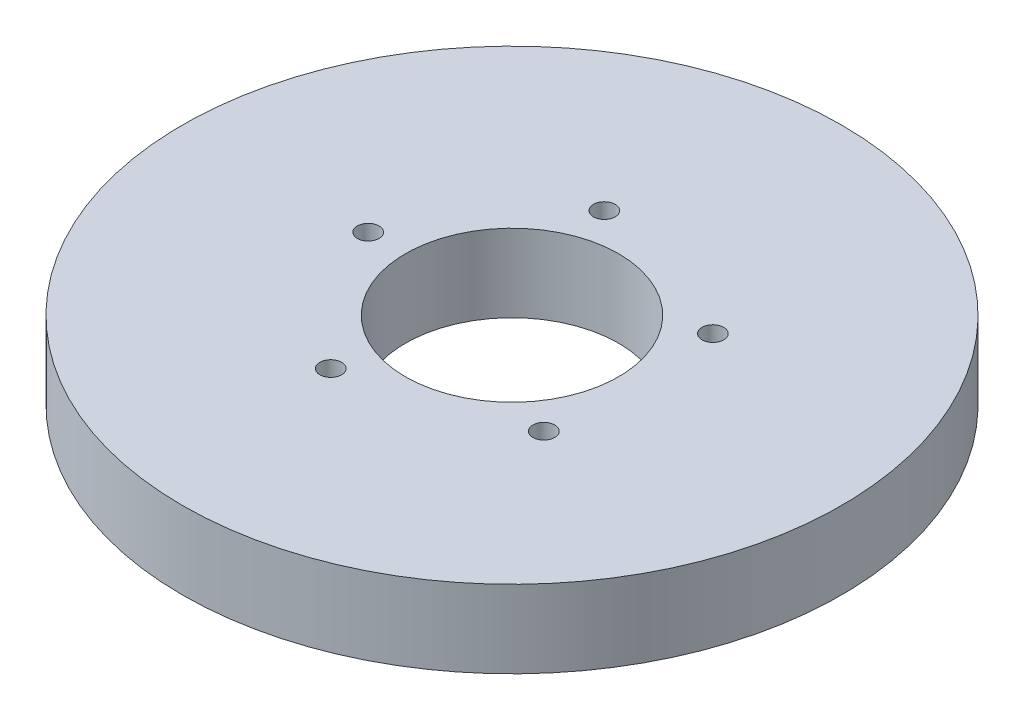
ISO-10303-21;
HEADER;
FILE_DESCRIPTION(('STEP AP214'),'2;1');
FILE_NAME('part.step','',(''),(''),'','','');
FILE_SCHEMA(('AUTOMOTIVE_DESIGN { 1 0 10303 214 1 1 1 1 }'));
ENDSEC;
DATA;
#1=APPLICATION_CONTEXT('core data for automotive mechanical design processes');
#2=APPLICATION_PROTOCOL_DEFINITION('international standard','automotive_design',2000,#1);
#3=PRODUCT_CONTEXT('',#1,'mechanical');
#4=PRODUCT('Part','Part','',(#3));
#5=PRODUCT_RELATED_PRODUCT_CATEGORY('part','',(#4));
#6=PRODUCT_DEFINITION_FORMATION('','',#4);
#7=PRODUCT_DEFINITION_CONTEXT('part definition',#1,'design');
#8=PRODUCT_DEFINITION('design','',#6,#7);
#9=PRODUCT_DEFINITION_SHAPE('','',#8);
#10=(LENGTH_UNIT() NAMED_UNIT(*) SI_UNIT(.MILLI.,.METRE.));
#11=(NAMED_UNIT(*) PLANE_ANGLE_UNIT() SI_UNIT($,.RADIAN.));
#12=(NAMED_UNIT(*) SI_UNIT($,.STERADIAN.) SOLID_ANGLE_UNIT());
#13=UNCERTAINTY_MEASURE_WITH_UNIT(LENGTH_MEASURE(1.E-05),#10,'distance_accuracy_value','');
#14=(GEOMETRIC_REPRESENTATION_CONTEXT(3) GLOBAL_UNCERTAINTY_ASSIGNED_CONTEXT((#13)) GLOBAL_UNIT_ASSIGNED_CONTEXT((#10,
#11,#12)) REPRESENTATION_CONTEXT('',''));
#15=CARTESIAN_POINT('',(0.,0.,0.));
#16=DIRECTION('',(0.,0.,1.));
#17=DIRECTION('',(1.,0.,0.));
#18=AXIS2_PLACEMENT_3D('',#15,#16,#17);
#19=CARTESIAN_POINT('',(0.,20.,0.));
#20=DIRECTION('',(0.,-1.,0.));
#21=DIRECTION('',(0.,0.,-1.));
#22=AXIS2_PLACEMENT_3D('',#19,#20,#21);
#23=CYLINDRICAL_SURFACE('',#22,85.);
#24=CARTESIAN_POINT('',(0.,20.,0.));
#25=DIRECTION('',(0.,1.,0.));
#26=DIRECTION('',(0.,0.,1.));
#27=AXIS2_PLACEMENT_3D('',#24,#25,#26);
#28=CIRCLE('',#27,85.);
#29=CARTESIAN_POINT('',(0.,20.,85.));
#30=VERTEX_POINT('',#29);
#31=EDGE_CURVE('E10',#30,#30,#28,.T.);
#32=ORIENTED_EDGE('',*,*,#31,.F.);
#33=EDGE_LOOP('',(#32));
#34=FACE_BOUND('',#33,.T.);
#35=CARTESIAN_POINT('',(0.,0.,0.));
#36=DIRECTION('',(0.,1.,0.));
#37=DIRECTION('',(0.,0.,1.));
#38=AXIS2_PLACEMENT_3D('',#35,#36,#37);
#39=CIRCLE('',#38,85.);
#40=CARTESIAN_POINT('',(0.,0.,85.));
#41=VERTEX_POINT('',#40);
#42=EDGE_CURVE('E37',#41,#41,#39,.T.);
#43=ORIENTED_EDGE('',*,*,#42,.T.);
#44=EDGE_LOOP('',(#43));
#45=FACE_BOUND('',#44,.T.);
#46=ADVANCED_FACE('F40',(#34,#45),#23,.T.);
#47=CARTESIAN_POINT('',(0.,20.,0.));
#48=DIRECTION('',(0.,1.,0.));
#49=DIRECTION('',(0.,0.,1.));
#50=AXIS2_PLACEMENT_3D('',#47,#48,#49);
#51=PLANE('',#50);
#52=CARTESIAN_POINT('',(-11.4625068656685,20.,35.2779686752267));
#53=DIRECTION('',(0.,1.,0.));
#54=DIRECTION('',(0.951056516295155,0.,0.309016994374945));
#55=AXIS2_PLACEMENT_3D('',#52,#53,#54);
#56=CIRCLE('',#55,2.80475320982171);
#57=CARTESIAN_POINT('',(-8.79502804886783,20.,36.1446850820893));
#58=VERTEX_POINT('',#57);
#59=EDGE_CURVE('E78',#58,#58,#56,.T.);
#60=ORIENTED_EDGE('',*,*,#59,.F.);
#61=EDGE_LOOP('',(#60));
#62=FACE_BOUND('',#61,.T.);
#63=CARTESIAN_POINT('',(30.0092325705996,20.,21.802983695344));
#64=DIRECTION('',(0.,1.,0.));
#65=DIRECTION('',(0.587785252292469,0.,-0.809016994374951));
#66=AXIS2_PLACEMENT_3D('',#63,#64,#65);
#67=CIRCLE('',#66,2.80475320982171);
#68=CARTESIAN_POINT('',(31.6578251436528,20.,19.5338906835705));
#69=VERTEX_POINT('',#68);
#70=EDGE_CURVE('E71',#69,#69,#67,.T.);
#71=ORIENTED_EDGE('',*,*,#70,.F.);
#72=EDGE_LOOP('',(#71));
#73=FACE_BOUND('',#72,.T.);
#74=CARTESIAN_POINT('',(30.0092325705993,20.,-21.8029836953444));
#75=DIRECTION('',(0.,1.,0.));
#76=DIRECTION('',(-0.58778525229248,0.,-0.809016994374942));
#77=AXIS2_PLACEMENT_3D('',#74,#75,#76);
#78=CIRCLE('',#77,2.80475320982171);
#79=CARTESIAN_POINT('',(28.3606399975461,20.,-24.0720767071179));
#80=VERTEX_POINT('',#79);
#81=EDGE_CURVE('E70',#80,#80,#78,.T.);
#82=ORIENTED_EDGE('',*,*,#81,.F.);
#83=EDGE_LOOP('',(#82));
#84=FACE_BOUND('',#83,.T.);
#85=CARTESIAN_POINT('',(-11.462506865669,20.,-35.2779686752265));
#86=DIRECTION('',(0.,1.,0.));
#87=DIRECTION('',(-0.95105651629515,0.,0.309016994374958));
#88=AXIS2_PLACEMENT_3D('',#85,#86,#87);
#89=CIRCLE('',#88,2.80475320982171);
#90=CARTESIAN_POINT('',(-14.1299856824697,20.,-34.4112522683639));
#91=VERTEX_POINT('',#90);
#92=EDGE_CURVE('E61',#91,#91,#89,.T.);
#93=ORIENTED_EDGE('',*,*,#92,.F.);
#94=EDGE_LOOP('',(#93));
#95=FACE_BOUND('',#94,.T.);
#96=CARTESIAN_POINT('',(-37.0934514098617,20.,0.));
#97=DIRECTION('',(0.,1.,0.));
#98=DIRECTION('',(0.,0.,1.));
#99=AXIS2_PLACEMENT_3D('',#96,#97,#98);
#100=CIRCLE('',#99,2.80475320982171);
#101=CARTESIAN_POINT('',(-37.0934514098617,20.,2.80475320982171));
#102=VERTEX_POINT('',#101);
#103=EDGE_CURVE('E54',#102,#102,#100,.T.);
#104=ORIENTED_EDGE('',*,*,#103,.F.);
#105=EDGE_LOOP('',(#104));
#106=FACE_BOUND('',#105,.T.);
#107=CARTESIAN_POINT('',(0.,20.,0.));
#108=DIRECTION('',(0.,1.,0.));
#109=DIRECTION('',(0.,0.,1.));
#110=AXIS2_PLACEMENT_3D('',#107,#108,#109);
#111=CIRCLE('',#110,27.5);
#112=CARTESIAN_POINT('',(0.,20.,27.5));
#113=VERTEX_POINT('',#112);
#114=EDGE_CURVE('E50',#113,#113,#111,.T.);
#115=ORIENTED_EDGE('',*,*,#114,.F.);
#116=EDGE_LOOP('',(#115));
#117=FACE_BOUND('',#116,.T.);
#118=ORIENTED_EDGE('',*,*,#31,.T.);
#119=EDGE_LOOP('',(#118));
#120=FACE_BOUND('',#119,.T.);
#121=ADVANCED_FACE('F94',(#62,#73,#84,#95,#106,#117,#120),#51,.T.);
#122=CARTESIAN_POINT('',(0.,0.,0.));
#123=DIRECTION('',(0.,1.,0.));
#124=DIRECTION('',(0.,0.,1.));
#125=AXIS2_PLACEMENT_3D('',#122,#123,#124);
#126=PLANE('',#125);
#127=CARTESIAN_POINT('',(0.,0.,0.));
#128=DIRECTION('',(0.,1.,0.));
#129=DIRECTION('',(0.,0.,1.));
#130=AXIS2_PLACEMENT_3D('',#127,#128,#129);
#131=CIRCLE('',#130,27.5);
#132=CARTESIAN_POINT('',(0.,0.,27.5));
#133=VERTEX_POINT('',#132);
#134=EDGE_CURVE('E47',#133,#133,#131,.T.);
#135=ORIENTED_EDGE('',*,*,#134,.T.);
#136=EDGE_LOOP('',(#135));
#137=FACE_BOUND('',#136,.T.);
#138=ORIENTED_EDGE('',*,*,#42,.F.);
#139=EDGE_LOOP('',(#138));
#140=FACE_BOUND('',#139,.T.);
#141=ADVANCED_FACE('F100',(#137,#140),#126,.F.);
#142=CARTESIAN_POINT('',(0.,20.,0.));
#143=DIRECTION('',(0.,-1.,0.));
#144=DIRECTION('',(0.,0.,-1.));
#145=AXIS2_PLACEMENT_3D('',#142,#143,#144);
#146=CYLINDRICAL_SURFACE('',#145,27.5);
#147=ORIENTED_EDGE('',*,*,#114,.T.);
#148=EDGE_LOOP('',(#147));
#149=FACE_BOUND('',#148,.T.);
#150=ORIENTED_EDGE('',*,*,#134,.F.);
#151=EDGE_LOOP('',(#150));
#152=FACE_BOUND('',#151,.T.);
#153=ADVANCED_FACE('F108',(#149,#152),#146,.F.);
#154=CARTESIAN_POINT('',(-37.0934514098617,2.33509567441192,0.));
#155=DIRECTION('',(0.,1.,0.));
#156=DIRECTION('',(0.,0.,1.));
#157=AXIS2_PLACEMENT_3D('',#154,#155,#156);
#158=CYLINDRICAL_SURFACE('',#157,2.80475320982171);
#159=CARTESIAN_POINT('',(-37.0934514098617,2.33509567441192,0.));
#160=DIRECTION('',(0.,1.,0.));
#161=DIRECTION('',(0.,0.,1.));
#162=AXIS2_PLACEMENT_3D('',#159,#160,#161);
#163=CIRCLE('',#162,2.80475320982171);
#164=CARTESIAN_POINT('',(-37.0934514098617,2.33509567441192,2.80475320982171));
#165=VERTEX_POINT('',#164);
#166=EDGE_CURVE('E55',#165,#165,#163,.T.);
#167=ORIENTED_EDGE('',*,*,#166,.F.);
#168=EDGE_LOOP('',(#167));
#169=FACE_BOUND('',#168,.T.);
#170=ORIENTED_EDGE('',*,*,#103,.T.);
#171=EDGE_LOOP('',(#170));
#172=FACE_BOUND('',#171,.T.);
#173=ADVANCED_FACE('F115',(#169,#172),#158,.F.);
#174=CARTESIAN_POINT('',(-37.0934514098617,2.33509567441192,0.));
#175=DIRECTION('',(0.,1.,0.));
#176=DIRECTION('',(0.,0.,1.));
#177=AXIS2_PLACEMENT_3D('',#174,#175,#176);
#178=PLANE('',#177);
#179=ORIENTED_EDGE('',*,*,#166,.T.);
#180=EDGE_LOOP('',(#179));
#181=FACE_BOUND('',#180,.T.);
#182=ADVANCED_FACE('F142',(#181),#178,.T.);
#183=CARTESIAN_POINT('',(-11.462506865669,2.33509567441192,-35.2779686752265));
#184=DIRECTION('',(0.,1.,0.));
#185=DIRECTION('',(0.,0.,1.));
#186=AXIS2_PLACEMENT_3D('',#183,#184,#185);
#187=CYLINDRICAL_SURFACE('',#186,2.80475320982171);
#188=CARTESIAN_POINT('',(-11.462506865669,2.33509567441192,-35.2779686752265));
#189=DIRECTION('',(0.,1.,0.));
#190=DIRECTION('',(-0.95105651629515,0.,0.309016994374958));
#191=AXIS2_PLACEMENT_3D('',#188,#189,#190);
#192=CIRCLE('',#191,2.80475320982171);
#193=CARTESIAN_POINT('',(-14.1299856824697,2.33509567441192,-34.4112522683639));
#194=VERTEX_POINT('',#193);
#195=EDGE_CURVE('E63',#194,#194,#192,.T.);
#196=ORIENTED_EDGE('',*,*,#195,.F.);
#197=EDGE_LOOP('',(#196));
#198=FACE_BOUND('',#197,.T.);
#199=ORIENTED_EDGE('',*,*,#92,.T.);
#200=EDGE_LOOP('',(#199));
#201=FACE_BOUND('',#200,.T.);
#202=ADVANCED_FACE('F147',(#198,#201),#187,.F.);
#203=CARTESIAN_POINT('',(-11.462506865669,2.33509567441192,-35.2779686752265));
#204=DIRECTION('',(0.,1.,0.));
#205=DIRECTION('',(-0.95105651629515,0.,0.309016994374958));
#206=AXIS2_PLACEMENT_3D('',#203,#204,#205);
#207=PLANE('',#206);
#208=ORIENTED_EDGE('',*,*,#195,.T.);
#209=EDGE_LOOP('',(#208));
#210=FACE_BOUND('',#209,.T.);
#211=ADVANCED_FACE('F163',(#210),#207,.T.);
#212=CARTESIAN_POINT('',(30.0092325705993,2.33509567441192,-21.8029836953444));
#213=DIRECTION('',(0.,1.,0.));
#214=DIRECTION('',(0.,0.,1.));
#215=AXIS2_PLACEMENT_3D('',#212,#213,#214);
#216=CYLINDRICAL_SURFACE('',#215,2.80475320982171);
#217=CARTESIAN_POINT('',(30.0092325705993,2.33509567441192,-21.8029836953444));
#218=DIRECTION('',(0.,1.,0.));
#219=DIRECTION('',(-0.58778525229248,0.,-0.809016994374942));
#220=AXIS2_PLACEMENT_3D('',#217,#218,#219);
#221=CIRCLE('',#220,2.80475320982171);
#222=CARTESIAN_POINT('',(28.3606399975461,2.33509567441192,-24.0720767071179));
#223=VERTEX_POINT('',#222);
#224=EDGE_CURVE('E69',#223,#223,#221,.T.);
#225=ORIENTED_EDGE('',*,*,#224,.F.);
#226=EDGE_LOOP('',(#225));
#227=FACE_BOUND('',#226,.T.);
#228=ORIENTED_EDGE('',*,*,#81,.T.);
#229=EDGE_LOOP('',(#228));
#230=FACE_BOUND('',#229,.T.);
#231=ADVANCED_FACE('F172',(#227,#230),#216,.F.);
#232=CARTESIAN_POINT('',(30.0092325705993,2.33509567441192,-21.8029836953444));
#233=DIRECTION('',(0.,1.,0.));
#234=DIRECTION('',(-0.58778525229248,0.,-0.809016994374942));
#235=AXIS2_PLACEMENT_3D('',#232,#233,#234);
#236=PLANE('',#235);
#237=ORIENTED_EDGE('',*,*,#224,.T.);
#238=EDGE_LOOP('',(#237));
#239=FACE_BOUND('',#238,.T.);
#240=ADVANCED_FACE('F185',(#239),#236,.T.);
#241=CARTESIAN_POINT('',(30.0092325705996,2.33509567441192,21.802983695344));
#242=DIRECTION('',(0.,1.,0.));
#243=DIRECTION('',(0.,0.,1.));
#244=AXIS2_PLACEMENT_3D('',#241,#242,#243);
#245=CYLINDRICAL_SURFACE('',#244,2.80475320982171);
#246=CARTESIAN_POINT('',(30.0092325705996,2.33509567441192,21.802983695344));
#247=DIRECTION('',(0.,1.,0.));
#248=DIRECTION('',(0.587785252292469,0.,-0.809016994374951));
#249=AXIS2_PLACEMENT_3D('',#246,#247,#248);
#250=CIRCLE('',#249,2.80475320982171);
#251=CARTESIAN_POINT('',(31.6578251436528,2.33509567441192,19.5338906835705));
#252=VERTEX_POINT('',#251);
#253=EDGE_CURVE('E76',#252,#252,#250,.T.);
#254=ORIENTED_EDGE('',*,*,#253,.F.);
#255=EDGE_LOOP('',(#254));
#256=FACE_BOUND('',#255,.T.);
#257=ORIENTED_EDGE('',*,*,#70,.T.);
#258=EDGE_LOOP('',(#257));
#259=FACE_BOUND('',#258,.T.);
#260=ADVANCED_FACE('F191',(#256,#259),#245,.F.);
#261=CARTESIAN_POINT('',(30.0092325705996,2.33509567441192,21.802983695344));
#262=DIRECTION('',(0.,1.,0.));
#263=DIRECTION('',(0.587785252292469,0.,-0.809016994374951));
#264=AXIS2_PLACEMENT_3D('',#261,#262,#263);
#265=PLANE('',#264);
#266=ORIENTED_EDGE('',*,*,#253,.T.);
#267=EDGE_LOOP('',(#266));
#268=FACE_BOUND('',#267,.T.);
#269=ADVANCED_FACE('F89',(#268),#265,.T.);
#270=CARTESIAN_POINT('',(-11.4625068656685,2.33509567441192,35.2779686752267));
#271=DIRECTION('',(0.,1.,0.));
#272=DIRECTION('',(0.,0.,1.));
#273=AXIS2_PLACEMENT_3D('',#270,#271,#272);
#274=CYLINDRICAL_SURFACE('',#273,2.80475320982171);
#275=CARTESIAN_POINT('',(-11.4625068656685,2.33509567441192,35.2779686752267));
#276=DIRECTION('',(0.,1.,0.));
#277=DIRECTION('',(0.951056516295155,0.,0.309016994374945));
#278=AXIS2_PLACEMENT_3D('',#275,#276,#277);
#279=CIRCLE('',#278,2.80475320982171);
#280=CARTESIAN_POINT('',(-8.79502804886783,2.33509567441192,36.1446850820893));
#281=VERTEX_POINT('',#280);
#282=EDGE_CURVE('E59',#281,#281,#279,.T.);
#283=ORIENTED_EDGE('',*,*,#282,.F.);
#284=EDGE_LOOP('',(#283));
#285=FACE_BOUND('',#284,.T.);
#286=ORIENTED_EDGE('',*,*,#59,.T.);
#287=EDGE_LOOP('',(#286));
#288=FACE_BOUND('',#287,.T.);
#289=ADVANCED_FACE('F87',(#285,#288),#274,.F.);
#290=CARTESIAN_POINT('',(-11.4625068656685,2.33509567441192,35.2779686752267));
#291=DIRECTION('',(0.,1.,0.));
#292=DIRECTION('',(0.951056516295155,0.,0.309016994374945));
#293=AXIS2_PLACEMENT_3D('',#290,#291,#292);
#294=PLANE('',#293);
#295=ORIENTED_EDGE('',*,*,#282,.T.);
#296=EDGE_LOOP('',(#295));
#297=FACE_BOUND('',#296,.T.);
#298=ADVANCED_FACE('F84',(#297),#294,.T.);
#299=CLOSED_SHELL('',(#46,#121,#141,#153,#173,#182,#202,#211,#231,#240,#260,#269,#289,#298));
#300=MANIFOLD_SOLID_BREP('B2',#299);
#301=ADVANCED_BREP_SHAPE_REPRESENTATION('',(#18,#300),#14);
#302=SHAPE_DEFINITION_REPRESENTATION(#9,#301);
ENDSEC;
END-ISO-10303-21;
